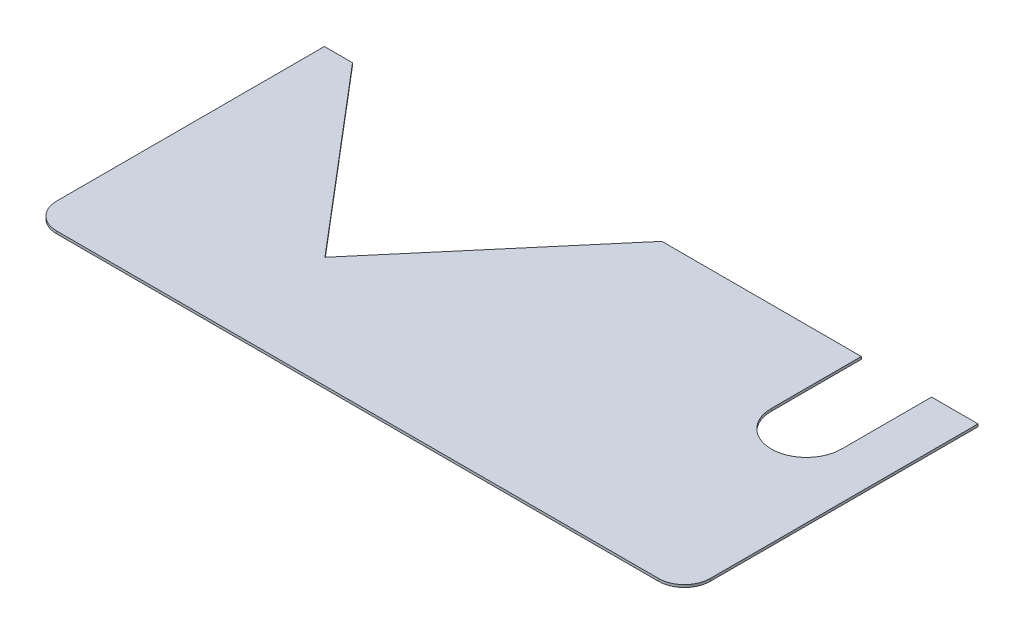
ISO-10303-21;
HEADER;
FILE_DESCRIPTION(('STEP AP214'),'2;1');
FILE_NAME('part.step','',(''),(''),'','','');
FILE_SCHEMA(('AUTOMOTIVE_DESIGN { 1 0 10303 214 1 1 1 1 }'));
ENDSEC;
DATA;
#1=APPLICATION_CONTEXT('core data for automotive mechanical design processes');
#2=APPLICATION_PROTOCOL_DEFINITION('international standard','automotive_design',2000,#1);
#3=PRODUCT_CONTEXT('',#1,'mechanical');
#4=PRODUCT('Part','Part','',(#3));
#5=PRODUCT_RELATED_PRODUCT_CATEGORY('part','',(#4));
#6=PRODUCT_DEFINITION_FORMATION('','',#4);
#7=PRODUCT_DEFINITION_CONTEXT('part definition',#1,'design');
#8=PRODUCT_DEFINITION('design','',#6,#7);
#9=PRODUCT_DEFINITION_SHAPE('','',#8);
#10=(LENGTH_UNIT() NAMED_UNIT(*) SI_UNIT(.MILLI.,.METRE.));
#11=(NAMED_UNIT(*) PLANE_ANGLE_UNIT() SI_UNIT($,.RADIAN.));
#12=(NAMED_UNIT(*) SI_UNIT($,.STERADIAN.) SOLID_ANGLE_UNIT());
#13=UNCERTAINTY_MEASURE_WITH_UNIT(LENGTH_MEASURE(1.E-05),#10,'distance_accuracy_value','');
#14=(GEOMETRIC_REPRESENTATION_CONTEXT(3) GLOBAL_UNCERTAINTY_ASSIGNED_CONTEXT((#13)) GLOBAL_UNIT_ASSIGNED_CONTEXT((#10,
#11,#12)) REPRESENTATION_CONTEXT('',''));
#15=CARTESIAN_POINT('',(0.,0.,0.));
#16=DIRECTION('',(0.,0.,1.));
#17=DIRECTION('',(1.,0.,0.));
#18=AXIS2_PLACEMENT_3D('',#15,#16,#17);
#19=CARTESIAN_POINT('',(116.2,0.,-52.2));
#20=DIRECTION('',(0.,0.,-1.));
#21=DIRECTION('',(-1.,0.,0.));
#22=AXIS2_PLACEMENT_3D('',#19,#20,#21);
#23=PLANE('',#22);
#24=DIRECTION('',(0.,1.,0.));
#25=VECTOR('',#24,1.);
#26=CARTESIAN_POINT('',(3.8,-0.9,-52.2));
#27=LINE('',#26,#25);
#28=CARTESIAN_POINT('',(3.8,-0.9,-52.2));
#29=VERTEX_POINT('',#28);
#30=CARTESIAN_POINT('',(3.8,0.,-52.2));
#31=VERTEX_POINT('',#30);
#32=EDGE_CURVE('E227',#29,#31,#27,.T.);
#33=ORIENTED_EDGE('',*,*,#32,.T.);
#34=DIRECTION('',(-1.,0.,0.));
#35=VECTOR('',#34,1.);
#36=CARTESIAN_POINT('',(116.2,0.,-52.2));
#37=LINE('',#36,#35);
#38=CARTESIAN_POINT('',(74.7,0.,-52.2));
#39=VERTEX_POINT('',#38);
#40=EDGE_CURVE('E160',#39,#31,#37,.T.);
#41=ORIENTED_EDGE('',*,*,#40,.F.);
#42=DIRECTION('',(0.,1.,0.));
#43=VECTOR('',#42,1.);
#44=CARTESIAN_POINT('',(74.7,-0.9,-52.2));
#45=LINE('',#44,#43);
#46=CARTESIAN_POINT('',(74.7,-0.9,-52.2));
#47=VERTEX_POINT('',#46);
#48=EDGE_CURVE('E214',#47,#39,#45,.T.);
#49=ORIENTED_EDGE('',*,*,#48,.F.);
#50=DIRECTION('',(-1.,0.,0.));
#51=VECTOR('',#50,1.);
#52=CARTESIAN_POINT('',(116.2,-0.9,-52.2));
#53=LINE('',#52,#51);
#54=EDGE_CURVE('E154',#47,#29,#53,.T.);
#55=ORIENTED_EDGE('',*,*,#54,.T.);
#56=EDGE_LOOP('',(#33,#41,#49,#55));
#57=FACE_BOUND('',#56,.T.);
#58=ADVANCED_FACE('F38',(#57),#23,.T.);
#59=DIRECTION('',(0.,1.,0.));
#60=VECTOR('',#59,1.);
#61=CARTESIAN_POINT('',(-106.2,-0.9,-52.2));
#62=LINE('',#61,#60);
#63=CARTESIAN_POINT('',(-106.2,-0.9,-52.2));
#64=VERTEX_POINT('',#63);
#65=CARTESIAN_POINT('',(-106.2,0.,-52.2));
#66=VERTEX_POINT('',#65);
#67=EDGE_CURVE('E53',#64,#66,#62,.T.);
#68=ORIENTED_EDGE('',*,*,#67,.F.);
#69=CARTESIAN_POINT('',(-116.2,-0.9,-52.2));
#70=VERTEX_POINT('',#69);
#71=EDGE_CURVE('E146',#64,#70,#53,.T.);
#72=ORIENTED_EDGE('',*,*,#71,.T.);
#73=DIRECTION('',(0.,-1.,0.));
#74=VECTOR('',#73,1.);
#75=CARTESIAN_POINT('',(-116.2,0.,-52.2));
#76=LINE('',#75,#74);
#77=CARTESIAN_POINT('',(-116.2,0.,-52.2));
#78=VERTEX_POINT('',#77);
#79=EDGE_CURVE('E213',#78,#70,#76,.T.);
#80=ORIENTED_EDGE('',*,*,#79,.F.);
#81=EDGE_CURVE('E148',#66,#78,#37,.T.);
#82=ORIENTED_EDGE('',*,*,#81,.F.);
#83=EDGE_LOOP('',(#68,#72,#80,#82));
#84=FACE_BOUND('',#83,.T.);
#85=ADVANCED_FACE('F144',(#84),#23,.T.);
#86=CARTESIAN_POINT('',(116.2,-0.9,52.2));
#87=DIRECTION('',(0.,1.,0.));
#88=DIRECTION('',(0.,0.,1.));
#89=AXIS2_PLACEMENT_3D('',#86,#87,#88);
#90=PLANE('',#89);
#91=DIRECTION('',(0.647058823529412,0.,0.762440082165631));
#92=VECTOR('',#91,1.);
#93=CARTESIAN_POINT('',(-106.2,-0.9,-52.2));
#94=LINE('',#93,#92);
#95=CARTESIAN_POINT('',(-51.2,-0.9,12.6074069840786));
#96=VERTEX_POINT('',#95);
#97=EDGE_CURVE('E132',#64,#96,#94,.T.);
#98=ORIENTED_EDGE('',*,*,#97,.T.);
#99=DIRECTION('',(0.647058823529412,0.,-0.762440082165631));
#100=VECTOR('',#99,1.);
#101=CARTESIAN_POINT('',(-51.2,-0.9,12.6074069840786));
#102=LINE('',#101,#100);
#103=EDGE_CURVE('E139',#96,#29,#102,.T.);
#104=ORIENTED_EDGE('',*,*,#103,.T.);
#105=ORIENTED_EDGE('',*,*,#54,.F.);
#106=DIRECTION('',(0.,0.,1.));
#107=VECTOR('',#106,1.);
#108=CARTESIAN_POINT('',(74.7,-0.9,-52.2));
#109=LINE('',#108,#107);
#110=CARTESIAN_POINT('',(74.7,-0.9,-20.2));
#111=VERTEX_POINT('',#110);
#112=EDGE_CURVE('E236',#47,#111,#109,.T.);
#113=ORIENTED_EDGE('',*,*,#112,.T.);
#114=CARTESIAN_POINT('',(87.2,-0.9,-20.2));
#115=DIRECTION('',(0.,1.,0.));
#116=DIRECTION('',(0.,0.,1.));
#117=AXIS2_PLACEMENT_3D('',#114,#115,#116);
#118=CIRCLE('',#117,12.5);
#119=CARTESIAN_POINT('',(99.7,-0.9,-20.2));
#120=VERTEX_POINT('',#119);
#121=EDGE_CURVE('E239',#111,#120,#118,.T.);
#122=ORIENTED_EDGE('',*,*,#121,.T.);
#123=DIRECTION('',(0.,0.,-1.));
#124=VECTOR('',#123,1.);
#125=CARTESIAN_POINT('',(99.7,-0.9,-52.2));
#126=LINE('',#125,#124);
#127=CARTESIAN_POINT('',(99.7,-0.9,-52.2));
#128=VERTEX_POINT('',#127);
#129=EDGE_CURVE('E243',#120,#128,#126,.T.);
#130=ORIENTED_EDGE('',*,*,#129,.T.);
#131=CARTESIAN_POINT('',(116.2,-0.9,-52.2));
#132=VERTEX_POINT('',#131);
#133=EDGE_CURVE('E157',#132,#128,#53,.T.);
#134=ORIENTED_EDGE('',*,*,#133,.F.);
#135=DIRECTION('',(0.,0.,-1.));
#136=VECTOR('',#135,1.);
#137=CARTESIAN_POINT('',(116.2,-0.9,52.2));
#138=LINE('',#137,#136);
#139=CARTESIAN_POINT('',(116.2,-0.9,43.));
#140=VERTEX_POINT('',#139);
#141=EDGE_CURVE('E189',#140,#132,#138,.T.);
#142=ORIENTED_EDGE('',*,*,#141,.F.);
#143=CARTESIAN_POINT('',(107.,-0.9,43.));
#144=DIRECTION('',(0.,1.,0.));
#145=DIRECTION('',(0.,0.,1.));
#146=AXIS2_PLACEMENT_3D('',#143,#144,#145);
#147=CIRCLE('',#146,9.2);
#148=CARTESIAN_POINT('',(107.,-0.9,52.2));
#149=VERTEX_POINT('',#148);
#150=EDGE_CURVE('E46',#140,#149,#147,.F.);
#151=ORIENTED_EDGE('',*,*,#150,.T.);
#152=DIRECTION('',(-1.,0.,0.));
#153=VECTOR('',#152,1.);
#154=CARTESIAN_POINT('',(116.2,-0.9,52.2));
#155=LINE('',#154,#153);
#156=CARTESIAN_POINT('',(-107.,-0.9,52.2));
#157=VERTEX_POINT('',#156);
#158=EDGE_CURVE('E187',#149,#157,#155,.T.);
#159=ORIENTED_EDGE('',*,*,#158,.T.);
#160=CARTESIAN_POINT('',(-107.,-0.9,43.));
#161=DIRECTION('',(0.,1.,0.));
#162=DIRECTION('',(0.,0.,1.));
#163=AXIS2_PLACEMENT_3D('',#160,#161,#162);
#164=CIRCLE('',#163,9.2);
#165=CARTESIAN_POINT('',(-116.2,-0.9,43.));
#166=VERTEX_POINT('',#165);
#167=EDGE_CURVE('E184',#157,#166,#164,.F.);
#168=ORIENTED_EDGE('',*,*,#167,.T.);
#169=DIRECTION('',(0.,0.,-1.));
#170=VECTOR('',#169,1.);
#171=CARTESIAN_POINT('',(-116.2,-0.9,52.2));
#172=LINE('',#171,#170);
#173=EDGE_CURVE('E152',#166,#70,#172,.T.);
#174=ORIENTED_EDGE('',*,*,#173,.T.);
#175=ORIENTED_EDGE('',*,*,#71,.F.);
#176=EDGE_LOOP('',(#98,#104,#105,#113,#122,#130,#134,#142,#151,#159,#168,#174,#175));
#177=FACE_BOUND('',#176,.T.);
#178=ADVANCED_FACE('F150',(#177),#90,.F.);
#179=DIRECTION('',(0.,1.,0.));
#180=VECTOR('',#179,1.);
#181=CARTESIAN_POINT('',(99.7,-0.9,-52.2));
#182=LINE('',#181,#180);
#183=CARTESIAN_POINT('',(99.7,0.,-52.2));
#184=VERTEX_POINT('',#183);
#185=EDGE_CURVE('E251',#128,#184,#182,.T.);
#186=ORIENTED_EDGE('',*,*,#185,.T.);
#187=CARTESIAN_POINT('',(116.2,0.,-52.2));
#188=VERTEX_POINT('',#187);
#189=EDGE_CURVE('E155',#188,#184,#37,.T.);
#190=ORIENTED_EDGE('',*,*,#189,.F.);
#191=DIRECTION('',(0.,-1.,0.));
#192=VECTOR('',#191,1.);
#193=CARTESIAN_POINT('',(116.2,0.,-52.2));
#194=LINE('',#193,#192);
#195=EDGE_CURVE('E207',#188,#132,#194,.T.);
#196=ORIENTED_EDGE('',*,*,#195,.T.);
#197=ORIENTED_EDGE('',*,*,#133,.T.);
#198=EDGE_LOOP('',(#186,#190,#196,#197));
#199=FACE_BOUND('',#198,.T.);
#200=ADVANCED_FACE('F256',(#199),#23,.T.);
#201=CARTESIAN_POINT('',(116.2,0.,52.2));
#202=DIRECTION('',(0.,1.,0.));
#203=DIRECTION('',(0.,0.,1.));
#204=AXIS2_PLACEMENT_3D('',#201,#202,#203);
#205=PLANE('',#204);
#206=DIRECTION('',(0.647058823529412,0.,-0.762440082165631));
#207=VECTOR('',#206,1.);
#208=CARTESIAN_POINT('',(-51.2,0.,12.6074069840786));
#209=LINE('',#208,#207);
#210=CARTESIAN_POINT('',(-51.2,0.,12.6074069840786));
#211=VERTEX_POINT('',#210);
#212=EDGE_CURVE('E140',#211,#31,#209,.T.);
#213=ORIENTED_EDGE('',*,*,#212,.F.);
#214=DIRECTION('',(0.647058823529412,0.,0.762440082165631));
#215=VECTOR('',#214,1.);
#216=CARTESIAN_POINT('',(-106.2,0.,-52.2));
#217=LINE('',#216,#215);
#218=EDGE_CURVE('E265',#66,#211,#217,.T.);
#219=ORIENTED_EDGE('',*,*,#218,.F.);
#220=ORIENTED_EDGE('',*,*,#81,.T.);
#221=DIRECTION('',(0.,0.,-1.));
#222=VECTOR('',#221,1.);
#223=CARTESIAN_POINT('',(-116.2,0.,52.2));
#224=LINE('',#223,#222);
#225=CARTESIAN_POINT('',(-116.2,0.,43.));
#226=VERTEX_POINT('',#225);
#227=EDGE_CURVE('E216',#226,#78,#224,.T.);
#228=ORIENTED_EDGE('',*,*,#227,.F.);
#229=CARTESIAN_POINT('',(-107.,0.,43.));
#230=DIRECTION('',(0.,1.,0.));
#231=DIRECTION('',(0.,0.,1.));
#232=AXIS2_PLACEMENT_3D('',#229,#230,#231);
#233=CIRCLE('',#232,9.2);
#234=CARTESIAN_POINT('',(-107.,0.,52.2));
#235=VERTEX_POINT('',#234);
#236=EDGE_CURVE('E176',#226,#235,#233,.T.);
#237=ORIENTED_EDGE('',*,*,#236,.T.);
#238=DIRECTION('',(-1.,0.,0.));
#239=VECTOR('',#238,1.);
#240=CARTESIAN_POINT('',(116.2,0.,52.2));
#241=LINE('',#240,#239);
#242=CARTESIAN_POINT('',(107.,0.,52.2));
#243=VERTEX_POINT('',#242);
#244=EDGE_CURVE('E195',#243,#235,#241,.T.);
#245=ORIENTED_EDGE('',*,*,#244,.F.);
#246=CARTESIAN_POINT('',(107.,0.,43.));
#247=DIRECTION('',(0.,1.,0.));
#248=DIRECTION('',(0.,0.,1.));
#249=AXIS2_PLACEMENT_3D('',#246,#247,#248);
#250=CIRCLE('',#249,9.2);
#251=CARTESIAN_POINT('',(116.2,0.,43.));
#252=VERTEX_POINT('',#251);
#253=EDGE_CURVE('E180',#243,#252,#250,.T.);
#254=ORIENTED_EDGE('',*,*,#253,.T.);
#255=DIRECTION('',(0.,0.,-1.));
#256=VECTOR('',#255,1.);
#257=CARTESIAN_POINT('',(116.2,0.,52.2));
#258=LINE('',#257,#256);
#259=EDGE_CURVE('E196',#252,#188,#258,.T.);
#260=ORIENTED_EDGE('',*,*,#259,.T.);
#261=ORIENTED_EDGE('',*,*,#189,.T.);
#262=DIRECTION('',(0.,0.,-1.));
#263=VECTOR('',#262,1.);
#264=CARTESIAN_POINT('',(99.7,0.,-52.2));
#265=LINE('',#264,#263);
#266=CARTESIAN_POINT('',(99.7,0.,-20.2));
#267=VERTEX_POINT('',#266);
#268=EDGE_CURVE('E240',#267,#184,#265,.T.);
#269=ORIENTED_EDGE('',*,*,#268,.F.);
#270=CARTESIAN_POINT('',(87.2,0.,-20.2));
#271=DIRECTION('',(0.,1.,0.));
#272=DIRECTION('',(0.,0.,1.));
#273=AXIS2_PLACEMENT_3D('',#270,#271,#272);
#274=CIRCLE('',#273,12.5);
#275=CARTESIAN_POINT('',(74.7,0.,-20.2));
#276=VERTEX_POINT('',#275);
#277=EDGE_CURVE('E230',#276,#267,#274,.T.);
#278=ORIENTED_EDGE('',*,*,#277,.F.);
#279=DIRECTION('',(0.,0.,1.));
#280=VECTOR('',#279,1.);
#281=CARTESIAN_POINT('',(74.7,0.,-52.2));
#282=LINE('',#281,#280);
#283=EDGE_CURVE('E61',#39,#276,#282,.T.);
#284=ORIENTED_EDGE('',*,*,#283,.F.);
#285=ORIENTED_EDGE('',*,*,#40,.T.);
#286=EDGE_LOOP('',(#213,#219,#220,#228,#237,#245,#254,#260,#261,#269,#278,#284,#285));
#287=FACE_BOUND('',#286,.T.);
#288=ADVANCED_FACE('F202',(#287),#205,.T.);
#289=CARTESIAN_POINT('',(116.2,-0.9,52.2));
#290=DIRECTION('',(0.,0.,1.));
#291=DIRECTION('',(1.,0.,0.));
#292=AXIS2_PLACEMENT_3D('',#289,#290,#291);
#293=PLANE('',#292);
#294=ORIENTED_EDGE('',*,*,#158,.F.);
#295=DIRECTION('',(0.,1.,0.));
#296=VECTOR('',#295,1.);
#297=CARTESIAN_POINT('',(107.,0.,52.2));
#298=LINE('',#297,#296);
#299=EDGE_CURVE('E169',#149,#243,#298,.T.);
#300=ORIENTED_EDGE('',*,*,#299,.T.);
#301=ORIENTED_EDGE('',*,*,#244,.T.);
#302=DIRECTION('',(0.,1.,0.));
#303=VECTOR('',#302,1.);
#304=CARTESIAN_POINT('',(-107.,-0.9,52.2));
#305=LINE('',#304,#303);
#306=EDGE_CURVE('E164',#235,#157,#305,.F.);
#307=ORIENTED_EDGE('',*,*,#306,.T.);
#308=EDGE_LOOP('',(#294,#300,#301,#307));
#309=FACE_BOUND('',#308,.T.);
#310=ADVANCED_FACE('F193',(#309),#293,.T.);
#311=CARTESIAN_POINT('',(116.2,0.,0.));
#312=DIRECTION('',(-1.,0.,0.));
#313=DIRECTION('',(0.,0.,1.));
#314=AXIS2_PLACEMENT_3D('',#311,#312,#313);
#315=PLANE('',#314);
#316=ORIENTED_EDGE('',*,*,#259,.F.);
#317=DIRECTION('',(0.,1.,0.));
#318=VECTOR('',#317,1.);
#319=CARTESIAN_POINT('',(116.2,-0.9,43.));
#320=LINE('',#319,#318);
#321=EDGE_CURVE('E182',#252,#140,#320,.F.);
#322=ORIENTED_EDGE('',*,*,#321,.T.);
#323=ORIENTED_EDGE('',*,*,#141,.T.);
#324=ORIENTED_EDGE('',*,*,#195,.F.);
#325=EDGE_LOOP('',(#316,#322,#323,#324));
#326=FACE_BOUND('',#325,.T.);
#327=ADVANCED_FACE('F206',(#326),#315,.F.);
#328=CARTESIAN_POINT('',(-116.2,0.,0.));
#329=DIRECTION('',(-1.,0.,0.));
#330=DIRECTION('',(0.,0.,1.));
#331=AXIS2_PLACEMENT_3D('',#328,#329,#330);
#332=PLANE('',#331);
#333=ORIENTED_EDGE('',*,*,#173,.F.);
#334=DIRECTION('',(0.,1.,0.));
#335=VECTOR('',#334,1.);
#336=CARTESIAN_POINT('',(-116.2,0.,43.));
#337=LINE('',#336,#335);
#338=EDGE_CURVE('E11',#166,#226,#337,.T.);
#339=ORIENTED_EDGE('',*,*,#338,.T.);
#340=ORIENTED_EDGE('',*,*,#227,.T.);
#341=ORIENTED_EDGE('',*,*,#79,.T.);
#342=EDGE_LOOP('',(#333,#339,#340,#341));
#343=FACE_BOUND('',#342,.T.);
#344=ADVANCED_FACE('F290',(#343),#332,.T.);
#345=CARTESIAN_POINT('',(107.,-0.9,43.));
#346=DIRECTION('',(0.,-1.,0.));
#347=DIRECTION('',(0.,0.,-1.));
#348=AXIS2_PLACEMENT_3D('',#345,#346,#347);
#349=CYLINDRICAL_SURFACE('',#348,9.2);
#350=ORIENTED_EDGE('',*,*,#150,.F.);
#351=ORIENTED_EDGE('',*,*,#321,.F.);
#352=ORIENTED_EDGE('',*,*,#253,.F.);
#353=ORIENTED_EDGE('',*,*,#299,.F.);
#354=EDGE_LOOP('',(#350,#351,#352,#353));
#355=FACE_BOUND('',#354,.T.);
#356=ADVANCED_FACE('F198',(#355),#349,.T.);
#357=CARTESIAN_POINT('',(-107.,0.,43.));
#358=DIRECTION('',(0.,1.,0.));
#359=DIRECTION('',(0.,0.,1.));
#360=AXIS2_PLACEMENT_3D('',#357,#358,#359);
#361=CYLINDRICAL_SURFACE('',#360,9.2);
#362=ORIENTED_EDGE('',*,*,#167,.F.);
#363=ORIENTED_EDGE('',*,*,#306,.F.);
#364=ORIENTED_EDGE('',*,*,#236,.F.);
#365=ORIENTED_EDGE('',*,*,#338,.F.);
#366=EDGE_LOOP('',(#362,#363,#364,#365));
#367=FACE_BOUND('',#366,.T.);
#368=ADVANCED_FACE('F40',(#367),#361,.T.);
#369=CARTESIAN_POINT('',(74.7,-0.9,-52.2));
#370=DIRECTION('',(-1.,0.,0.));
#371=DIRECTION('',(0.,0.,1.));
#372=AXIS2_PLACEMENT_3D('',#369,#370,#371);
#373=PLANE('',#372);
#374=ORIENTED_EDGE('',*,*,#283,.T.);
#375=DIRECTION('',(0.,1.,0.));
#376=VECTOR('',#375,1.);
#377=CARTESIAN_POINT('',(74.7,-0.9,-20.2));
#378=LINE('',#377,#376);
#379=EDGE_CURVE('E245',#111,#276,#378,.T.);
#380=ORIENTED_EDGE('',*,*,#379,.F.);
#381=ORIENTED_EDGE('',*,*,#112,.F.);
#382=ORIENTED_EDGE('',*,*,#48,.T.);
#383=EDGE_LOOP('',(#374,#380,#381,#382));
#384=FACE_BOUND('',#383,.T.);
#385=ADVANCED_FACE('F263',(#384),#373,.F.);
#386=CARTESIAN_POINT('',(99.7,-0.9,-52.2));
#387=DIRECTION('',(1.,0.,0.));
#388=DIRECTION('',(0.,0.,-1.));
#389=AXIS2_PLACEMENT_3D('',#386,#387,#388);
#390=PLANE('',#389);
#391=ORIENTED_EDGE('',*,*,#268,.T.);
#392=ORIENTED_EDGE('',*,*,#185,.F.);
#393=ORIENTED_EDGE('',*,*,#129,.F.);
#394=DIRECTION('',(0.,1.,0.));
#395=VECTOR('',#394,1.);
#396=CARTESIAN_POINT('',(99.7,-0.9,-20.2));
#397=LINE('',#396,#395);
#398=EDGE_CURVE('E253',#120,#267,#397,.T.);
#399=ORIENTED_EDGE('',*,*,#398,.T.);
#400=EDGE_LOOP('',(#391,#392,#393,#399));
#401=FACE_BOUND('',#400,.T.);
#402=ADVANCED_FACE('F259',(#401),#390,.F.);
#403=CARTESIAN_POINT('',(87.2,-0.9,-20.2));
#404=DIRECTION('',(0.,1.,0.));
#405=DIRECTION('',(0.,0.,1.));
#406=AXIS2_PLACEMENT_3D('',#403,#404,#405);
#407=CYLINDRICAL_SURFACE('',#406,12.5);
#408=ORIENTED_EDGE('',*,*,#277,.T.);
#409=ORIENTED_EDGE('',*,*,#398,.F.);
#410=ORIENTED_EDGE('',*,*,#121,.F.);
#411=ORIENTED_EDGE('',*,*,#379,.T.);
#412=EDGE_LOOP('',(#408,#409,#410,#411));
#413=FACE_BOUND('',#412,.T.);
#414=ADVANCED_FACE('F262',(#413),#407,.F.);
#415=CARTESIAN_POINT('',(-51.2,-0.9,12.6074069840786));
#416=DIRECTION('',(0.762440082165631,0.,0.647058823529412));
#417=DIRECTION('',(0.647058823529412,0.,-0.762440082165631));
#418=AXIS2_PLACEMENT_3D('',#415,#416,#417);
#419=PLANE('',#418);
#420=ORIENTED_EDGE('',*,*,#212,.T.);
#421=ORIENTED_EDGE('',*,*,#32,.F.);
#422=ORIENTED_EDGE('',*,*,#103,.F.);
#423=DIRECTION('',(0.,1.,0.));
#424=VECTOR('',#423,1.);
#425=CARTESIAN_POINT('',(-51.2,-0.9,12.6074069840786));
#426=LINE('',#425,#424);
#427=EDGE_CURVE('E134',#96,#211,#426,.T.);
#428=ORIENTED_EDGE('',*,*,#427,.T.);
#429=EDGE_LOOP('',(#420,#421,#422,#428));
#430=FACE_BOUND('',#429,.T.);
#431=ADVANCED_FACE('F266',(#430),#419,.F.);
#432=CARTESIAN_POINT('',(-106.2,-0.9,-52.2));
#433=DIRECTION('',(-0.762440082165631,0.,0.647058823529411));
#434=DIRECTION('',(0.647058823529412,0.,0.762440082165631));
#435=AXIS2_PLACEMENT_3D('',#432,#433,#434);
#436=PLANE('',#435);
#437=ORIENTED_EDGE('',*,*,#218,.T.);
#438=ORIENTED_EDGE('',*,*,#427,.F.);
#439=ORIENTED_EDGE('',*,*,#97,.F.);
#440=ORIENTED_EDGE('',*,*,#67,.T.);
#441=EDGE_LOOP('',(#437,#438,#439,#440));
#442=FACE_BOUND('',#441,.T.);
#443=ADVANCED_FACE('F133',(#442),#436,.F.);
#444=CLOSED_SHELL('',(#58,#85,#178,#200,#288,#310,#327,#344,#356,#368,#385,#402,#414,#431,#443));
#445=MANIFOLD_SOLID_BREP('B2',#444);
#446=ADVANCED_BREP_SHAPE_REPRESENTATION('',(#18,#445),#14);
#447=SHAPE_DEFINITION_REPRESENTATION(#9,#446);
ENDSEC;
END-ISO-10303-21;
